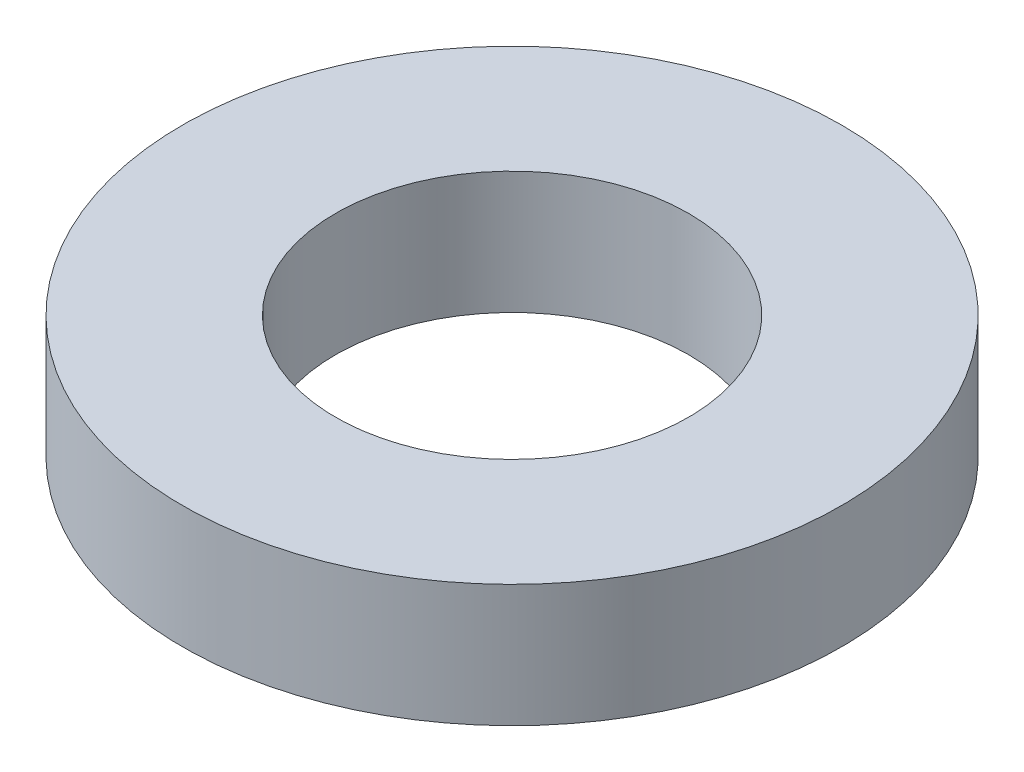
ISO-10303-21;
HEADER;
FILE_DESCRIPTION(('STEP AP214'),'2;1');
FILE_NAME('part.step','',(''),(''),'','','');
FILE_SCHEMA(('AUTOMOTIVE_DESIGN { 1 0 10303 214 1 1 1 1 }'));
ENDSEC;
DATA;
#1=APPLICATION_CONTEXT('core data for automotive mechanical design processes');
#2=APPLICATION_PROTOCOL_DEFINITION('international standard','automotive_design',2000,#1);
#3=PRODUCT_CONTEXT('',#1,'mechanical');
#4=PRODUCT('Part','Part','',(#3));
#5=PRODUCT_RELATED_PRODUCT_CATEGORY('part','',(#4));
#6=PRODUCT_DEFINITION_FORMATION('','',#4);
#7=PRODUCT_DEFINITION_CONTEXT('part definition',#1,'design');
#8=PRODUCT_DEFINITION('design','',#6,#7);
#9=PRODUCT_DEFINITION_SHAPE('','',#8);
#10=(LENGTH_UNIT() NAMED_UNIT(*) SI_UNIT(.MILLI.,.METRE.));
#11=(NAMED_UNIT(*) PLANE_ANGLE_UNIT() SI_UNIT($,.RADIAN.));
#12=(NAMED_UNIT(*) SI_UNIT($,.STERADIAN.) SOLID_ANGLE_UNIT());
#13=UNCERTAINTY_MEASURE_WITH_UNIT(LENGTH_MEASURE(1.E-05),#10,'distance_accuracy_value','');
#14=(GEOMETRIC_REPRESENTATION_CONTEXT(3) GLOBAL_UNCERTAINTY_ASSIGNED_CONTEXT((#13)) GLOBAL_UNIT_ASSIGNED_CONTEXT((#10,
#11,#12)) REPRESENTATION_CONTEXT('',''));
#15=CARTESIAN_POINT('',(0.,0.,0.));
#16=DIRECTION('',(0.,0.,1.));
#17=DIRECTION('',(1.,0.,0.));
#18=AXIS2_PLACEMENT_3D('',#15,#16,#17);
#19=CARTESIAN_POINT('',(0.,26.,0.));
#20=DIRECTION('',(0.,-1.,0.));
#21=DIRECTION('',(0.,0.,-1.));
#22=AXIS2_PLACEMENT_3D('',#19,#20,#21);
#23=CYLINDRICAL_SURFACE('',#22,70.);
#24=CARTESIAN_POINT('',(0.,26.,0.));
#25=DIRECTION('',(0.,1.,0.));
#26=DIRECTION('',(0.,0.,1.));
#27=AXIS2_PLACEMENT_3D('',#24,#25,#26);
#28=CIRCLE('',#27,70.);
#29=CARTESIAN_POINT('',(0.,26.,-70.));
#30=VERTEX_POINT('',#29);
#31=EDGE_CURVE('E10',#30,#30,#28,.T.);
#32=CARTESIAN_POINT('',(0.,0.,0.));
#33=DIRECTION('',(0.,1.,0.));
#34=DIRECTION('',(0.,0.,1.));
#35=AXIS2_PLACEMENT_3D('',#32,#33,#34);
#36=CIRCLE('',#35,70.);
#37=CARTESIAN_POINT('',(0.,0.,-70.));
#38=VERTEX_POINT('',#37);
#39=EDGE_CURVE('E37',#38,#38,#36,.T.);
#40=CARTESIAN_POINT('',(0.,26.,-70.));
#41=CARTESIAN_POINT('',(0.,25.7291666666667,-70.));
#42=CARTESIAN_POINT('',(0.,25.4583333333333,-70.));
#43=CARTESIAN_POINT('',(0.,24.9166666666667,-70.));
#44=CARTESIAN_POINT('',(0.,24.6458333333333,-70.));
#45=CARTESIAN_POINT('',(0.,24.1041666666667,-70.));
#46=CARTESIAN_POINT('',(0.,23.8333333333333,-70.));
#47=CARTESIAN_POINT('',(0.,23.2916666666667,-70.));
#48=CARTESIAN_POINT('',(0.,23.0208333333333,-70.));
#49=CARTESIAN_POINT('',(0.,22.4791666666667,-70.));
#50=CARTESIAN_POINT('',(0.,22.2083333333333,-70.));
#51=CARTESIAN_POINT('',(0.,21.6666666666667,-70.));
#52=CARTESIAN_POINT('',(0.,21.3958333333333,-70.));
#53=CARTESIAN_POINT('',(0.,20.8541666666667,-70.));
#54=CARTESIAN_POINT('',(0.,20.5833333333333,-70.));
#55=CARTESIAN_POINT('',(0.,20.0416666666667,-70.));
#56=CARTESIAN_POINT('',(0.,19.7708333333333,-70.));
#57=CARTESIAN_POINT('',(0.,19.2291666666667,-70.));
#58=CARTESIAN_POINT('',(0.,18.9583333333333,-70.));
#59=CARTESIAN_POINT('',(0.,18.4166666666667,-70.));
#60=CARTESIAN_POINT('',(0.,18.1458333333333,-70.));
#61=CARTESIAN_POINT('',(0.,17.6041666666667,-70.));
#62=CARTESIAN_POINT('',(0.,17.3333333333333,-70.));
#63=CARTESIAN_POINT('',(0.,16.7916666666667,-70.));
#64=CARTESIAN_POINT('',(0.,16.5208333333333,-70.));
#65=CARTESIAN_POINT('',(0.,15.9791666666667,-70.));
#66=CARTESIAN_POINT('',(0.,15.7083333333333,-70.));
#67=CARTESIAN_POINT('',(0.,15.1666666666667,-70.));
#68=CARTESIAN_POINT('',(0.,14.8958333333333,-70.));
#69=CARTESIAN_POINT('',(0.,14.3541666666667,-70.));
#70=CARTESIAN_POINT('',(0.,14.0833333333333,-70.));
#71=CARTESIAN_POINT('',(0.,13.5416666666667,-70.));
#72=CARTESIAN_POINT('',(0.,13.2708333333333,-70.));
#73=CARTESIAN_POINT('',(0.,12.7291666666667,-70.));
#74=CARTESIAN_POINT('',(0.,12.4583333333333,-70.));
#75=CARTESIAN_POINT('',(0.,11.9166666666667,-70.));
#76=CARTESIAN_POINT('',(0.,11.6458333333333,-70.));
#77=CARTESIAN_POINT('',(0.,11.1041666666667,-70.));
#78=CARTESIAN_POINT('',(0.,10.8333333333333,-70.));
#79=CARTESIAN_POINT('',(0.,10.2916666666667,-70.));
#80=CARTESIAN_POINT('',(0.,10.0208333333333,-70.));
#81=CARTESIAN_POINT('',(0.,9.47916666666667,-70.));
#82=CARTESIAN_POINT('',(0.,9.20833333333333,-70.));
#83=CARTESIAN_POINT('',(0.,8.66666666666667,-70.));
#84=CARTESIAN_POINT('',(0.,8.39583333333333,-70.));
#85=CARTESIAN_POINT('',(0.,7.85416666666667,-70.));
#86=CARTESIAN_POINT('',(0.,7.58333333333333,-70.));
#87=CARTESIAN_POINT('',(0.,7.04166666666667,-70.));
#88=CARTESIAN_POINT('',(0.,6.77083333333333,-70.));
#89=CARTESIAN_POINT('',(0.,6.22916666666667,-70.));
#90=CARTESIAN_POINT('',(0.,5.95833333333333,-70.));
#91=CARTESIAN_POINT('',(0.,5.41666666666667,-70.));
#92=CARTESIAN_POINT('',(0.,5.14583333333333,-70.));
#93=CARTESIAN_POINT('',(0.,4.60416666666667,-70.));
#94=CARTESIAN_POINT('',(0.,4.33333333333333,-70.));
#95=CARTESIAN_POINT('',(0.,3.79166666666667,-70.));
#96=CARTESIAN_POINT('',(0.,3.52083333333333,-70.));
#97=CARTESIAN_POINT('',(0.,2.97916666666667,-70.));
#98=CARTESIAN_POINT('',(0.,2.70833333333333,-70.));
#99=CARTESIAN_POINT('',(0.,2.16666666666667,-70.));
#100=CARTESIAN_POINT('',(0.,1.89583333333333,-70.));
#101=CARTESIAN_POINT('',(0.,1.35416666666667,-70.));
#102=CARTESIAN_POINT('',(0.,1.08333333333333,-70.));
#103=CARTESIAN_POINT('',(0.,0.541666666666667,-70.));
#104=CARTESIAN_POINT('',(0.,0.270833333333334,-70.));
#105=CARTESIAN_POINT('',(0.,0.,-70.));
#106=B_SPLINE_CURVE_WITH_KNOTS('',3,(#40,#41,#42,#43,#44,#45,#46,#47,#48,#49,#50,#51,#52,#53,
#54,#55,#56,#57,#58,#59,#60,#61,#62,#63,#64,#65,#66,#67,#68,#69,#70,#71,#72,#73,#74,#75,#76,#77,
#78,#79,#80,#81,#82,#83,#84,#85,#86,#87,#88,#89,#90,#91,#92,#93,#94,#95,#96,#97,#98,#99,#100,
#101,#102,#103,#104,#105),.UNSPECIFIED.,.F.,.F.,(4,2,2,2,2,2,2,2,2,2,2,2,2,2,2,2,2,2,2,2,2,2,2,
2,2,2,2,2,2,2,2,2,4),(0.,0.812500000000001,1.625,2.4375,3.25,4.0625,4.875,5.6875,6.5,7.3125,
8.125,8.9375,9.75,10.5625,11.375,12.1875,13.,13.8125,14.625,15.4375,16.25,17.0625,17.875,
18.6875,19.5,20.3125,21.125,21.9375,22.75,23.5625,24.375,25.1875,26.),.UNSPECIFIED.);
#107=EDGE_CURVE('BSEAM40',#30,#38,#106,.T.);
#108=ORIENTED_EDGE('',*,*,#31,.F.);
#109=ORIENTED_EDGE('',*,*,#39,.T.);
#110=ORIENTED_EDGE('',*,*,#107,.T.);
#111=ORIENTED_EDGE('',*,*,#107,.F.);
#112=EDGE_LOOP('',(#108,#110,#109,#111));
#113=FACE_BOUND('',#112,.T.);
#114=ADVANCED_FACE('F40',(#113),#23,.T.);
#115=CARTESIAN_POINT('',(0.,26.,0.));
#116=DIRECTION('',(0.,1.,0.));
#117=DIRECTION('',(0.,0.,1.));
#118=AXIS2_PLACEMENT_3D('',#115,#116,#117);
#119=PLANE('',#118);
#120=CARTESIAN_POINT('',(0.,26.,0.));
#121=DIRECTION('',(0.,1.,0.));
#122=DIRECTION('',(0.,0.,1.));
#123=AXIS2_PLACEMENT_3D('',#120,#121,#122);
#124=CIRCLE('',#123,37.5);
#125=CARTESIAN_POINT('',(0.,26.,-37.5));
#126=VERTEX_POINT('',#125);
#127=EDGE_CURVE('E50',#126,#126,#124,.T.);
#128=ORIENTED_EDGE('',*,*,#127,.F.);
#129=EDGE_LOOP('',(#128));
#130=FACE_BOUND('',#129,.T.);
#131=ORIENTED_EDGE('',*,*,#31,.T.);
#132=EDGE_LOOP('',(#131));
#133=FACE_BOUND('',#132,.T.);
#134=ADVANCED_FACE('F59',(#130,#133),#119,.T.);
#135=CARTESIAN_POINT('',(0.,0.,0.));
#136=DIRECTION('',(0.,1.,0.));
#137=DIRECTION('',(0.,0.,1.));
#138=AXIS2_PLACEMENT_3D('',#135,#136,#137);
#139=PLANE('',#138);
#140=CARTESIAN_POINT('',(0.,0.,0.));
#141=DIRECTION('',(0.,1.,0.));
#142=DIRECTION('',(0.,0.,1.));
#143=AXIS2_PLACEMENT_3D('',#140,#141,#142);
#144=CIRCLE('',#143,37.5);
#145=CARTESIAN_POINT('',(0.,0.,-37.5));
#146=VERTEX_POINT('',#145);
#147=EDGE_CURVE('E47',#146,#146,#144,.T.);
#148=ORIENTED_EDGE('',*,*,#147,.T.);
#149=EDGE_LOOP('',(#148));
#150=FACE_BOUND('',#149,.T.);
#151=ORIENTED_EDGE('',*,*,#39,.F.);
#152=EDGE_LOOP('',(#151));
#153=FACE_BOUND('',#152,.T.);
#154=ADVANCED_FACE('F58',(#150,#153),#139,.F.);
#155=CARTESIAN_POINT('',(0.,26.,0.));
#156=DIRECTION('',(0.,-1.,0.));
#157=DIRECTION('',(0.,0.,-1.));
#158=AXIS2_PLACEMENT_3D('',#155,#156,#157);
#159=CYLINDRICAL_SURFACE('',#158,37.5);
#160=CARTESIAN_POINT('',(0.,26.,-37.5));
#161=CARTESIAN_POINT('',(0.,25.7291666666667,-37.5));
#162=CARTESIAN_POINT('',(0.,25.4583333333333,-37.5));
#163=CARTESIAN_POINT('',(0.,24.9166666666667,-37.5));
#164=CARTESIAN_POINT('',(0.,24.6458333333333,-37.5));
#165=CARTESIAN_POINT('',(0.,24.1041666666667,-37.5));
#166=CARTESIAN_POINT('',(0.,23.8333333333333,-37.5));
#167=CARTESIAN_POINT('',(0.,23.2916666666667,-37.5));
#168=CARTESIAN_POINT('',(0.,23.0208333333333,-37.5));
#169=CARTESIAN_POINT('',(0.,22.4791666666667,-37.5));
#170=CARTESIAN_POINT('',(0.,22.2083333333333,-37.5));
#171=CARTESIAN_POINT('',(0.,21.6666666666667,-37.5));
#172=CARTESIAN_POINT('',(0.,21.3958333333333,-37.5));
#173=CARTESIAN_POINT('',(0.,20.8541666666667,-37.5));
#174=CARTESIAN_POINT('',(0.,20.5833333333333,-37.5));
#175=CARTESIAN_POINT('',(0.,20.0416666666667,-37.5));
#176=CARTESIAN_POINT('',(0.,19.7708333333333,-37.5));
#177=CARTESIAN_POINT('',(0.,19.2291666666667,-37.5));
#178=CARTESIAN_POINT('',(0.,18.9583333333333,-37.5));
#179=CARTESIAN_POINT('',(0.,18.4166666666667,-37.5));
#180=CARTESIAN_POINT('',(0.,18.1458333333333,-37.5));
#181=CARTESIAN_POINT('',(0.,17.6041666666667,-37.5));
#182=CARTESIAN_POINT('',(0.,17.3333333333333,-37.5));
#183=CARTESIAN_POINT('',(0.,16.7916666666667,-37.5));
#184=CARTESIAN_POINT('',(0.,16.5208333333333,-37.5));
#185=CARTESIAN_POINT('',(0.,15.9791666666667,-37.5));
#186=CARTESIAN_POINT('',(0.,15.7083333333333,-37.5));
#187=CARTESIAN_POINT('',(0.,15.1666666666667,-37.5));
#188=CARTESIAN_POINT('',(0.,14.8958333333333,-37.5));
#189=CARTESIAN_POINT('',(0.,14.3541666666667,-37.5));
#190=CARTESIAN_POINT('',(0.,14.0833333333333,-37.5));
#191=CARTESIAN_POINT('',(0.,13.5416666666667,-37.5));
#192=CARTESIAN_POINT('',(0.,13.2708333333333,-37.5));
#193=CARTESIAN_POINT('',(0.,12.7291666666667,-37.5));
#194=CARTESIAN_POINT('',(0.,12.4583333333333,-37.5));
#195=CARTESIAN_POINT('',(0.,11.9166666666667,-37.5));
#196=CARTESIAN_POINT('',(0.,11.6458333333333,-37.5));
#197=CARTESIAN_POINT('',(0.,11.1041666666667,-37.5));
#198=CARTESIAN_POINT('',(0.,10.8333333333333,-37.5));
#199=CARTESIAN_POINT('',(0.,10.2916666666667,-37.5));
#200=CARTESIAN_POINT('',(0.,10.0208333333333,-37.5));
#201=CARTESIAN_POINT('',(0.,9.47916666666667,-37.5));
#202=CARTESIAN_POINT('',(0.,9.20833333333333,-37.5));
#203=CARTESIAN_POINT('',(0.,8.66666666666667,-37.5));
#204=CARTESIAN_POINT('',(0.,8.39583333333333,-37.5));
#205=CARTESIAN_POINT('',(0.,7.85416666666667,-37.5));
#206=CARTESIAN_POINT('',(0.,7.58333333333333,-37.5));
#207=CARTESIAN_POINT('',(0.,7.04166666666667,-37.5));
#208=CARTESIAN_POINT('',(0.,6.77083333333333,-37.5));
#209=CARTESIAN_POINT('',(0.,6.22916666666667,-37.5));
#210=CARTESIAN_POINT('',(0.,5.95833333333333,-37.5));
#211=CARTESIAN_POINT('',(0.,5.41666666666667,-37.5));
#212=CARTESIAN_POINT('',(0.,5.14583333333333,-37.5));
#213=CARTESIAN_POINT('',(0.,4.60416666666667,-37.5));
#214=CARTESIAN_POINT('',(0.,4.33333333333333,-37.5));
#215=CARTESIAN_POINT('',(0.,3.79166666666667,-37.5));
#216=CARTESIAN_POINT('',(0.,3.52083333333333,-37.5));
#217=CARTESIAN_POINT('',(0.,2.97916666666667,-37.5));
#218=CARTESIAN_POINT('',(0.,2.70833333333333,-37.5));
#219=CARTESIAN_POINT('',(0.,2.16666666666667,-37.5));
#220=CARTESIAN_POINT('',(0.,1.89583333333333,-37.5));
#221=CARTESIAN_POINT('',(0.,1.35416666666667,-37.5));
#222=CARTESIAN_POINT('',(0.,1.08333333333333,-37.5));
#223=CARTESIAN_POINT('',(0.,0.541666666666667,-37.5));
#224=CARTESIAN_POINT('',(0.,0.270833333333334,-37.5));
#225=CARTESIAN_POINT('',(0.,0.,-37.5));
#226=B_SPLINE_CURVE_WITH_KNOTS('',3,(#160,#161,#162,#163,#164,#165,#166,#167,#168,#169,#170,
#171,#172,#173,#174,#175,#176,#177,#178,#179,#180,#181,#182,#183,#184,#185,#186,#187,#188,#189,
#190,#191,#192,#193,#194,#195,#196,#197,#198,#199,#200,#201,#202,#203,#204,#205,#206,#207,#208,
#209,#210,#211,#212,#213,#214,#215,#216,#217,#218,#219,#220,#221,#222,#223,#224,#225),
.UNSPECIFIED.,.F.,.F.,(4,2,2,2,2,2,2,2,2,2,2,2,2,2,2,2,2,2,2,2,2,2,2,2,2,2,2,2,2,2,2,2,4),(0.,
0.812499999999997,1.625,2.4375,3.25,4.0625,4.875,5.6875,6.5,7.3125,8.125,8.93749999999999,
9.74999999999999,10.5625,11.375,12.1875,13.,13.8125,14.625,15.4375,16.25,17.0625,17.875,18.6875,
19.5,20.3125,21.125,21.9375,22.75,23.5625,24.375,25.1875,26.),.UNSPECIFIED.);
#227=EDGE_CURVE('BSEAM54',#126,#146,#226,.T.);
#228=ORIENTED_EDGE('',*,*,#127,.T.);
#229=ORIENTED_EDGE('',*,*,#147,.F.);
#230=ORIENTED_EDGE('',*,*,#227,.T.);
#231=ORIENTED_EDGE('',*,*,#227,.F.);
#232=EDGE_LOOP('',(#228,#230,#229,#231));
#233=FACE_BOUND('',#232,.T.);
#234=ADVANCED_FACE('F54',(#233),#159,.F.);
#235=CLOSED_SHELL('',(#114,#134,#154,#234));
#236=MANIFOLD_SOLID_BREP('B2',#235);
#237=ADVANCED_BREP_SHAPE_REPRESENTATION('',(#18,#236),#14);
#238=SHAPE_DEFINITION_REPRESENTATION(#9,#237);
ENDSEC;
END-ISO-10303-21;
